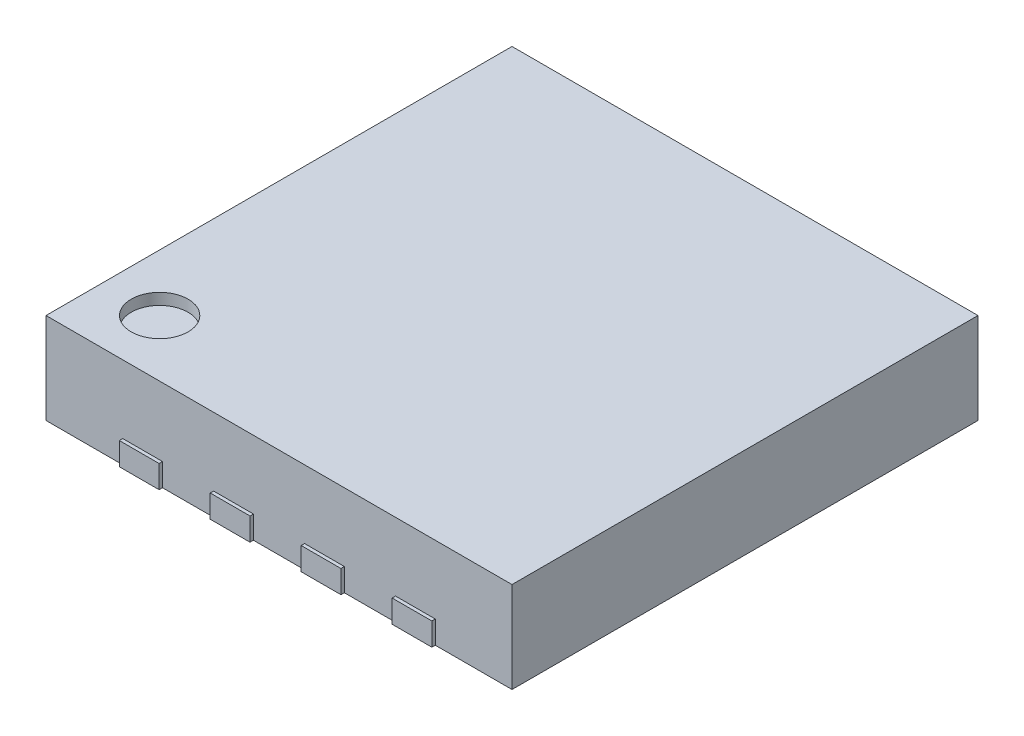
ISO-10303-21;
HEADER;
FILE_DESCRIPTION(('STEP AP214'),'2;1');
FILE_NAME('part.step','',(''),(''),'','','');
FILE_SCHEMA(('AUTOMOTIVE_DESIGN { 1 0 10303 214 1 1 1 1 }'));
ENDSEC;
DATA;
#1=APPLICATION_CONTEXT('core data for automotive mechanical design processes');
#2=APPLICATION_PROTOCOL_DEFINITION('international standard','automotive_design',2000,#1);
#3=PRODUCT_CONTEXT('',#1,'mechanical');
#4=PRODUCT('Part','Part','',(#3));
#5=PRODUCT_RELATED_PRODUCT_CATEGORY('part','',(#4));
#6=PRODUCT_DEFINITION_FORMATION('','',#4);
#7=PRODUCT_DEFINITION_CONTEXT('part definition',#1,'design');
#8=PRODUCT_DEFINITION('design','',#6,#7);
#9=PRODUCT_DEFINITION_SHAPE('','',#8);
#10=(LENGTH_UNIT() NAMED_UNIT(*) SI_UNIT(.MILLI.,.METRE.));
#11=(NAMED_UNIT(*) PLANE_ANGLE_UNIT() SI_UNIT($,.RADIAN.));
#12=(NAMED_UNIT(*) SI_UNIT($,.STERADIAN.) SOLID_ANGLE_UNIT());
#13=UNCERTAINTY_MEASURE_WITH_UNIT(LENGTH_MEASURE(1.E-05),#10,'distance_accuracy_value','');
#14=(GEOMETRIC_REPRESENTATION_CONTEXT(3) GLOBAL_UNCERTAINTY_ASSIGNED_CONTEXT((#13)) GLOBAL_UNIT_ASSIGNED_CONTEXT((#10,
#11,#12)) REPRESENTATION_CONTEXT('',''));
#15=CARTESIAN_POINT('',(0.,0.,0.));
#16=DIRECTION('',(0.,0.,1.));
#17=DIRECTION('',(1.,0.,0.));
#18=AXIS2_PLACEMENT_3D('',#15,#16,#17);
#19=CARTESIAN_POINT('',(-2.05,0.8,-2.05));
#20=DIRECTION('',(0.,0.,1.));
#21=DIRECTION('',(1.,0.,0.));
#22=AXIS2_PLACEMENT_3D('',#19,#20,#21);
#23=PLANE('',#22);
#24=DIRECTION('',(0.,1.,0.));
#25=VECTOR('',#24,1.);
#26=CARTESIAN_POINT('',(1.375,0.,-2.05));
#27=LINE('',#26,#25);
#28=CARTESIAN_POINT('',(1.375,0.,-2.05));
#29=VERTEX_POINT('',#28);
#30=CARTESIAN_POINT('',(1.375,0.2,-2.05));
#31=VERTEX_POINT('',#30);
#32=EDGE_CURVE('E53',#29,#31,#27,.T.);
#33=ORIENTED_EDGE('',*,*,#32,.T.);
#34=DIRECTION('',(-1.,0.,0.));
#35=VECTOR('',#34,1.);
#36=CARTESIAN_POINT('',(1.025,0.2,-2.05));
#37=LINE('',#36,#35);
#38=CARTESIAN_POINT('',(1.025,0.2,-2.05));
#39=VERTEX_POINT('',#38);
#40=EDGE_CURVE('E58',#31,#39,#37,.T.);
#41=ORIENTED_EDGE('',*,*,#40,.T.);
#42=DIRECTION('',(0.,-1.,0.));
#43=VECTOR('',#42,1.);
#44=CARTESIAN_POINT('',(1.025,0.,-2.05));
#45=LINE('',#44,#43);
#46=CARTESIAN_POINT('',(1.025,0.,-2.05));
#47=VERTEX_POINT('',#46);
#48=EDGE_CURVE('E284',#39,#47,#45,.T.);
#49=ORIENTED_EDGE('',*,*,#48,.T.);
#50=DIRECTION('',(-1.,0.,0.));
#51=VECTOR('',#50,1.);
#52=CARTESIAN_POINT('',(-2.05,0.,-2.05));
#53=LINE('',#52,#51);
#54=CARTESIAN_POINT('',(0.575,0.,-2.05));
#55=VERTEX_POINT('',#54);
#56=EDGE_CURVE('E39',#47,#55,#53,.T.);
#57=ORIENTED_EDGE('',*,*,#56,.T.);
#58=DIRECTION('',(0.,1.,0.));
#59=VECTOR('',#58,1.);
#60=CARTESIAN_POINT('',(0.575,0.,-2.05));
#61=LINE('',#60,#59);
#62=CARTESIAN_POINT('',(0.575,0.2,-2.05));
#63=VERTEX_POINT('',#62);
#64=EDGE_CURVE('E304',#55,#63,#61,.T.);
#65=ORIENTED_EDGE('',*,*,#64,.T.);
#66=DIRECTION('',(-1.,0.,0.));
#67=VECTOR('',#66,1.);
#68=CARTESIAN_POINT('',(0.225,0.2,-2.05));
#69=LINE('',#68,#67);
#70=CARTESIAN_POINT('',(0.225,0.2,-2.05));
#71=VERTEX_POINT('',#70);
#72=EDGE_CURVE('E306',#63,#71,#69,.T.);
#73=ORIENTED_EDGE('',*,*,#72,.T.);
#74=DIRECTION('',(0.,-1.,0.));
#75=VECTOR('',#74,1.);
#76=CARTESIAN_POINT('',(0.225,0.,-2.05));
#77=LINE('',#76,#75);
#78=CARTESIAN_POINT('',(0.225,0.,-2.05));
#79=VERTEX_POINT('',#78);
#80=EDGE_CURVE('E309',#71,#79,#77,.T.);
#81=ORIENTED_EDGE('',*,*,#80,.T.);
#82=CARTESIAN_POINT('',(-0.225,0.,-2.05));
#83=VERTEX_POINT('',#82);
#84=EDGE_CURVE('E282',#79,#83,#53,.T.);
#85=ORIENTED_EDGE('',*,*,#84,.T.);
#86=DIRECTION('',(0.,1.,0.));
#87=VECTOR('',#86,1.);
#88=CARTESIAN_POINT('',(-0.225,0.,-2.05));
#89=LINE('',#88,#87);
#90=CARTESIAN_POINT('',(-0.225,0.2,-2.05));
#91=VERTEX_POINT('',#90);
#92=EDGE_CURVE('E329',#83,#91,#89,.T.);
#93=ORIENTED_EDGE('',*,*,#92,.T.);
#94=DIRECTION('',(-1.,0.,0.));
#95=VECTOR('',#94,1.);
#96=CARTESIAN_POINT('',(-0.575,0.2,-2.05));
#97=LINE('',#96,#95);
#98=CARTESIAN_POINT('',(-0.575,0.2,-2.05));
#99=VERTEX_POINT('',#98);
#100=EDGE_CURVE('E331',#91,#99,#97,.T.);
#101=ORIENTED_EDGE('',*,*,#100,.T.);
#102=DIRECTION('',(0.,-1.,0.));
#103=VECTOR('',#102,1.);
#104=CARTESIAN_POINT('',(-0.575,0.,-2.05));
#105=LINE('',#104,#103);
#106=CARTESIAN_POINT('',(-0.575,0.,-2.05));
#107=VERTEX_POINT('',#106);
#108=EDGE_CURVE('E334',#99,#107,#105,.T.);
#109=ORIENTED_EDGE('',*,*,#108,.T.);
#110=CARTESIAN_POINT('',(-1.025,0.,-2.05));
#111=VERTEX_POINT('',#110);
#112=EDGE_CURVE('E377',#107,#111,#53,.T.);
#113=ORIENTED_EDGE('',*,*,#112,.T.);
#114=DIRECTION('',(0.,1.,0.));
#115=VECTOR('',#114,1.);
#116=CARTESIAN_POINT('',(-1.025,0.,-2.05));
#117=LINE('',#116,#115);
#118=CARTESIAN_POINT('',(-1.025,0.2,-2.05));
#119=VERTEX_POINT('',#118);
#120=EDGE_CURVE('E366',#111,#119,#117,.T.);
#121=ORIENTED_EDGE('',*,*,#120,.T.);
#122=DIRECTION('',(-1.,0.,0.));
#123=VECTOR('',#122,1.);
#124=CARTESIAN_POINT('',(-1.375,0.2,-2.05));
#125=LINE('',#124,#123);
#126=CARTESIAN_POINT('',(-1.375,0.2,-2.05));
#127=VERTEX_POINT('',#126);
#128=EDGE_CURVE('E359',#119,#127,#125,.T.);
#129=ORIENTED_EDGE('',*,*,#128,.T.);
#130=DIRECTION('',(0.,-1.,0.));
#131=VECTOR('',#130,1.);
#132=CARTESIAN_POINT('',(-1.375,0.,-2.05));
#133=LINE('',#132,#131);
#134=CARTESIAN_POINT('',(-1.375,0.,-2.05));
#135=VERTEX_POINT('',#134);
#136=EDGE_CURVE('E362',#127,#135,#133,.T.);
#137=ORIENTED_EDGE('',*,*,#136,.T.);
#138=CARTESIAN_POINT('',(-2.05,0.,-2.05));
#139=VERTEX_POINT('',#138);
#140=EDGE_CURVE('E378',#135,#139,#53,.T.);
#141=ORIENTED_EDGE('',*,*,#140,.T.);
#142=DIRECTION('',(0.,-1.,0.));
#143=VECTOR('',#142,1.);
#144=CARTESIAN_POINT('',(-2.05,0.8,-2.05));
#145=LINE('',#144,#143);
#146=CARTESIAN_POINT('',(-2.05,0.8,-2.05));
#147=VERTEX_POINT('',#146);
#148=EDGE_CURVE('E384',#147,#139,#145,.T.);
#149=ORIENTED_EDGE('',*,*,#148,.F.);
#150=DIRECTION('',(-1.,0.,0.));
#151=VECTOR('',#150,1.);
#152=CARTESIAN_POINT('',(-2.05,0.8,-2.05));
#153=LINE('',#152,#151);
#154=CARTESIAN_POINT('',(2.05,0.8,-2.05));
#155=VERTEX_POINT('',#154);
#156=EDGE_CURVE('E450',#155,#147,#153,.T.);
#157=ORIENTED_EDGE('',*,*,#156,.F.);
#158=DIRECTION('',(0.,-1.,0.));
#159=VECTOR('',#158,1.);
#160=CARTESIAN_POINT('',(2.05,0.8,-2.05));
#161=LINE('',#160,#159);
#162=CARTESIAN_POINT('',(2.05,0.,-2.05));
#163=VERTEX_POINT('',#162);
#164=EDGE_CURVE('E455',#155,#163,#161,.T.);
#165=ORIENTED_EDGE('',*,*,#164,.T.);
#166=EDGE_CURVE('E281',#163,#29,#53,.T.);
#167=ORIENTED_EDGE('',*,*,#166,.T.);
#168=EDGE_LOOP('',(#33,#41,#49,#57,#65,#73,#81,#85,#93,#101,#109,#113,#121,#129,#137,#141,#149,
#157,#165,#167));
#169=FACE_BOUND('',#168,.T.);
#170=ADVANCED_FACE('F35',(#169),#23,.F.);
#171=CARTESIAN_POINT('',(-2.05,0.8,2.05));
#172=DIRECTION('',(0.,0.,-1.));
#173=DIRECTION('',(-1.,0.,0.));
#174=AXIS2_PLACEMENT_3D('',#171,#172,#173);
#175=PLANE('',#174);
#176=DIRECTION('',(0.,1.,0.));
#177=VECTOR('',#176,1.);
#178=CARTESIAN_POINT('',(1.375,0.,2.05));
#179=LINE('',#178,#177);
#180=CARTESIAN_POINT('',(1.375,0.,2.05));
#181=VERTEX_POINT('',#180);
#182=CARTESIAN_POINT('',(1.375,0.2,2.05));
#183=VERTEX_POINT('',#182);
#184=EDGE_CURVE('E373',#181,#183,#179,.T.);
#185=ORIENTED_EDGE('',*,*,#184,.F.);
#186=DIRECTION('',(1.,0.,0.));
#187=VECTOR('',#186,1.);
#188=CARTESIAN_POINT('',(-2.05,0.,2.05));
#189=LINE('',#188,#187);
#190=CARTESIAN_POINT('',(2.05,0.,2.05));
#191=VERTEX_POINT('',#190);
#192=EDGE_CURVE('E395',#181,#191,#189,.T.);
#193=ORIENTED_EDGE('',*,*,#192,.T.);
#194=DIRECTION('',(0.,-1.,0.));
#195=VECTOR('',#194,1.);
#196=CARTESIAN_POINT('',(2.05,0.8,2.05));
#197=LINE('',#196,#195);
#198=CARTESIAN_POINT('',(2.05,0.8,2.05));
#199=VERTEX_POINT('',#198);
#200=EDGE_CURVE('E45',#199,#191,#197,.T.);
#201=ORIENTED_EDGE('',*,*,#200,.F.);
#202=DIRECTION('',(1.,0.,0.));
#203=VECTOR('',#202,1.);
#204=CARTESIAN_POINT('',(-2.05,0.8,2.05));
#205=LINE('',#204,#203);
#206=CARTESIAN_POINT('',(-2.05,0.8,2.05));
#207=VERTEX_POINT('',#206);
#208=EDGE_CURVE('E447',#207,#199,#205,.T.);
#209=ORIENTED_EDGE('',*,*,#208,.F.);
#210=DIRECTION('',(0.,-1.,0.));
#211=VECTOR('',#210,1.);
#212=CARTESIAN_POINT('',(-2.05,0.8,2.05));
#213=LINE('',#212,#211);
#214=CARTESIAN_POINT('',(-2.05,0.,2.05));
#215=VERTEX_POINT('',#214);
#216=EDGE_CURVE('E11',#207,#215,#213,.T.);
#217=ORIENTED_EDGE('',*,*,#216,.T.);
#218=CARTESIAN_POINT('',(-1.375,0.,2.05));
#219=VERTEX_POINT('',#218);
#220=EDGE_CURVE('E411',#215,#219,#189,.T.);
#221=ORIENTED_EDGE('',*,*,#220,.T.);
#222=DIRECTION('',(0.,-1.,0.));
#223=VECTOR('',#222,1.);
#224=CARTESIAN_POINT('',(-1.375,0.,2.05));
#225=LINE('',#224,#223);
#226=CARTESIAN_POINT('',(-1.375,0.2,2.05));
#227=VERTEX_POINT('',#226);
#228=EDGE_CURVE('E414',#227,#219,#225,.T.);
#229=ORIENTED_EDGE('',*,*,#228,.F.);
#230=DIRECTION('',(-1.,0.,0.));
#231=VECTOR('',#230,1.);
#232=CARTESIAN_POINT('',(-1.375,0.2,2.05));
#233=LINE('',#232,#231);
#234=CARTESIAN_POINT('',(-1.025,0.2,2.05));
#235=VERTEX_POINT('',#234);
#236=EDGE_CURVE('E427',#235,#227,#233,.T.);
#237=ORIENTED_EDGE('',*,*,#236,.F.);
#238=DIRECTION('',(0.,1.,0.));
#239=VECTOR('',#238,1.);
#240=CARTESIAN_POINT('',(-1.025,0.,2.05));
#241=LINE('',#240,#239);
#242=CARTESIAN_POINT('',(-1.025,0.,2.05));
#243=VERTEX_POINT('',#242);
#244=EDGE_CURVE('E418',#243,#235,#241,.T.);
#245=ORIENTED_EDGE('',*,*,#244,.F.);
#246=CARTESIAN_POINT('',(-0.575,0.,2.05));
#247=VERTEX_POINT('',#246);
#248=EDGE_CURVE('E406',#243,#247,#189,.T.);
#249=ORIENTED_EDGE('',*,*,#248,.T.);
#250=DIRECTION('',(0.,-1.,0.));
#251=VECTOR('',#250,1.);
#252=CARTESIAN_POINT('',(-0.575,0.,2.05));
#253=LINE('',#252,#251);
#254=CARTESIAN_POINT('',(-0.575,0.2,2.05));
#255=VERTEX_POINT('',#254);
#256=EDGE_CURVE('E477',#255,#247,#253,.T.);
#257=ORIENTED_EDGE('',*,*,#256,.F.);
#258=DIRECTION('',(-1.,0.,0.));
#259=VECTOR('',#258,1.);
#260=CARTESIAN_POINT('',(-0.575,0.2,2.05));
#261=LINE('',#260,#259);
#262=CARTESIAN_POINT('',(-0.225,0.2,2.05));
#263=VERTEX_POINT('',#262);
#264=EDGE_CURVE('E493',#263,#255,#261,.T.);
#265=ORIENTED_EDGE('',*,*,#264,.F.);
#266=DIRECTION('',(0.,1.,0.));
#267=VECTOR('',#266,1.);
#268=CARTESIAN_POINT('',(-0.225,0.,2.05));
#269=LINE('',#268,#267);
#270=CARTESIAN_POINT('',(-0.225,0.,2.05));
#271=VERTEX_POINT('',#270);
#272=EDGE_CURVE('E639',#271,#263,#269,.T.);
#273=ORIENTED_EDGE('',*,*,#272,.F.);
#274=CARTESIAN_POINT('',(0.225,0.,2.05));
#275=VERTEX_POINT('',#274);
#276=EDGE_CURVE('E412',#271,#275,#189,.T.);
#277=ORIENTED_EDGE('',*,*,#276,.T.);
#278=DIRECTION('',(0.,-1.,0.));
#279=VECTOR('',#278,1.);
#280=CARTESIAN_POINT('',(0.225,0.,2.05));
#281=LINE('',#280,#279);
#282=CARTESIAN_POINT('',(0.225,0.2,2.05));
#283=VERTEX_POINT('',#282);
#284=EDGE_CURVE('E614',#283,#275,#281,.T.);
#285=ORIENTED_EDGE('',*,*,#284,.F.);
#286=DIRECTION('',(-1.,0.,0.));
#287=VECTOR('',#286,1.);
#288=CARTESIAN_POINT('',(0.225,0.2,2.05));
#289=LINE('',#288,#287);
#290=CARTESIAN_POINT('',(0.575,0.2,2.05));
#291=VERTEX_POINT('',#290);
#292=EDGE_CURVE('E623',#291,#283,#289,.T.);
#293=ORIENTED_EDGE('',*,*,#292,.F.);
#294=DIRECTION('',(0.,1.,0.));
#295=VECTOR('',#294,1.);
#296=CARTESIAN_POINT('',(0.575,0.,2.05));
#297=LINE('',#296,#295);
#298=CARTESIAN_POINT('',(0.575,0.,2.05));
#299=VERTEX_POINT('',#298);
#300=EDGE_CURVE('E609',#299,#291,#297,.T.);
#301=ORIENTED_EDGE('',*,*,#300,.F.);
#302=CARTESIAN_POINT('',(1.025,0.,2.05));
#303=VERTEX_POINT('',#302);
#304=EDGE_CURVE('E397',#299,#303,#189,.T.);
#305=ORIENTED_EDGE('',*,*,#304,.T.);
#306=DIRECTION('',(0.,-1.,0.));
#307=VECTOR('',#306,1.);
#308=CARTESIAN_POINT('',(1.025,0.,2.05));
#309=LINE('',#308,#307);
#310=CARTESIAN_POINT('',(1.025,0.2,2.05));
#311=VERTEX_POINT('',#310);
#312=EDGE_CURVE('E584',#311,#303,#309,.T.);
#313=ORIENTED_EDGE('',*,*,#312,.F.);
#314=DIRECTION('',(-1.,0.,0.));
#315=VECTOR('',#314,1.);
#316=CARTESIAN_POINT('',(1.025,0.2,2.05));
#317=LINE('',#316,#315);
#318=EDGE_CURVE('E593',#183,#311,#317,.T.);
#319=ORIENTED_EDGE('',*,*,#318,.F.);
#320=EDGE_LOOP('',(#185,#193,#201,#209,#217,#221,#229,#237,#245,#249,#257,#265,#273,#277,#285,
#293,#301,#305,#313,#319));
#321=FACE_BOUND('',#320,.T.);
#322=ADVANCED_FACE('F476',(#321),#175,.F.);
#323=CARTESIAN_POINT('',(-2.05,0.8,2.05));
#324=DIRECTION('',(1.,0.,0.));
#325=DIRECTION('',(0.,0.,-1.));
#326=AXIS2_PLACEMENT_3D('',#323,#324,#325);
#327=PLANE('',#326);
#328=DIRECTION('',(0.,0.,1.));
#329=VECTOR('',#328,1.);
#330=CARTESIAN_POINT('',(-2.05,0.,2.05));
#331=LINE('',#330,#329);
#332=EDGE_CURVE('E398',#139,#215,#331,.T.);
#333=ORIENTED_EDGE('',*,*,#332,.T.);
#334=ORIENTED_EDGE('',*,*,#216,.F.);
#335=DIRECTION('',(0.,0.,1.));
#336=VECTOR('',#335,1.);
#337=CARTESIAN_POINT('',(-2.05,0.8,2.05));
#338=LINE('',#337,#336);
#339=EDGE_CURVE('E394',#147,#207,#338,.T.);
#340=ORIENTED_EDGE('',*,*,#339,.F.);
#341=ORIENTED_EDGE('',*,*,#148,.T.);
#342=EDGE_LOOP('',(#333,#334,#340,#341));
#343=FACE_BOUND('',#342,.T.);
#344=ADVANCED_FACE('F37',(#343),#327,.F.);
#345=CARTESIAN_POINT('',(2.05,0.8,2.05));
#346=DIRECTION('',(-1.,0.,0.));
#347=DIRECTION('',(0.,0.,1.));
#348=AXIS2_PLACEMENT_3D('',#345,#346,#347);
#349=PLANE('',#348);
#350=DIRECTION('',(0.,0.,-1.));
#351=VECTOR('',#350,1.);
#352=CARTESIAN_POINT('',(2.05,0.,2.05));
#353=LINE('',#352,#351);
#354=EDGE_CURVE('E382',#191,#163,#353,.T.);
#355=ORIENTED_EDGE('',*,*,#354,.T.);
#356=ORIENTED_EDGE('',*,*,#164,.F.);
#357=DIRECTION('',(0.,0.,-1.));
#358=VECTOR('',#357,1.);
#359=CARTESIAN_POINT('',(2.05,0.8,2.05));
#360=LINE('',#359,#358);
#361=EDGE_CURVE('E449',#199,#155,#360,.T.);
#362=ORIENTED_EDGE('',*,*,#361,.F.);
#363=ORIENTED_EDGE('',*,*,#200,.T.);
#364=EDGE_LOOP('',(#355,#356,#362,#363));
#365=FACE_BOUND('',#364,.T.);
#366=ADVANCED_FACE('F468',(#365),#349,.F.);
#367=CARTESIAN_POINT('',(0.,0.8,0.));
#368=DIRECTION('',(0.,-1.,0.));
#369=DIRECTION('',(0.,0.,-1.));
#370=AXIS2_PLACEMENT_3D('',#367,#368,#369);
#371=PLANE('',#370);
#372=CARTESIAN_POINT('',(-1.55,0.8,1.55));
#373=DIRECTION('',(0.,1.,0.));
#374=DIRECTION('',(0.,0.,1.));
#375=AXIS2_PLACEMENT_3D('',#372,#373,#374);
#376=CIRCLE('',#375,0.25);
#377=CARTESIAN_POINT('',(-1.55,0.8,1.8));
#378=VERTEX_POINT('',#377);
#379=EDGE_CURVE('E441',#378,#378,#376,.T.);
#380=ORIENTED_EDGE('',*,*,#379,.F.);
#381=EDGE_LOOP('',(#380));
#382=FACE_BOUND('',#381,.T.);
#383=ORIENTED_EDGE('',*,*,#339,.T.);
#384=ORIENTED_EDGE('',*,*,#208,.T.);
#385=ORIENTED_EDGE('',*,*,#361,.T.);
#386=ORIENTED_EDGE('',*,*,#156,.T.);
#387=EDGE_LOOP('',(#383,#384,#385,#386));
#388=FACE_BOUND('',#387,.T.);
#389=ADVANCED_FACE('F550',(#382,#388),#371,.F.);
#390=CARTESIAN_POINT('',(0.,0.,0.));
#391=DIRECTION('',(0.,-1.,0.));
#392=DIRECTION('',(0.,0.,-1.));
#393=AXIS2_PLACEMENT_3D('',#390,#391,#392);
#394=PLANE('',#393);
#395=ORIENTED_EDGE('',*,*,#332,.F.);
#396=ORIENTED_EDGE('',*,*,#140,.F.);
#397=DIRECTION('',(0.,0.,-1.));
#398=VECTOR('',#397,1.);
#399=CARTESIAN_POINT('',(-1.375,0.,-2.05));
#400=LINE('',#399,#398);
#401=CARTESIAN_POINT('',(-1.375,0.,-2.08));
#402=VERTEX_POINT('',#401);
#403=EDGE_CURVE('E370',#135,#402,#400,.T.);
#404=ORIENTED_EDGE('',*,*,#403,.T.);
#405=DIRECTION('',(1.,0.,0.));
#406=VECTOR('',#405,1.);
#407=CARTESIAN_POINT('',(-1.375,0.,-2.08));
#408=LINE('',#407,#406);
#409=CARTESIAN_POINT('',(-1.025,0.,-2.08));
#410=VERTEX_POINT('',#409);
#411=EDGE_CURVE('E984',#402,#410,#408,.T.);
#412=ORIENTED_EDGE('',*,*,#411,.T.);
#413=DIRECTION('',(0.,0.,-1.));
#414=VECTOR('',#413,1.);
#415=CARTESIAN_POINT('',(-1.025,0.,-2.05));
#416=LINE('',#415,#414);
#417=EDGE_CURVE('E374',#111,#410,#416,.T.);
#418=ORIENTED_EDGE('',*,*,#417,.F.);
#419=ORIENTED_EDGE('',*,*,#112,.F.);
#420=DIRECTION('',(0.,0.,-1.));
#421=VECTOR('',#420,1.);
#422=CARTESIAN_POINT('',(-0.575,0.,-2.05));
#423=LINE('',#422,#421);
#424=CARTESIAN_POINT('',(-0.575,0.,-2.08));
#425=VERTEX_POINT('',#424);
#426=EDGE_CURVE('E337',#107,#425,#423,.T.);
#427=ORIENTED_EDGE('',*,*,#426,.T.);
#428=DIRECTION('',(1.,0.,0.));
#429=VECTOR('',#428,1.);
#430=CARTESIAN_POINT('',(-0.575,0.,-2.08));
#431=LINE('',#430,#429);
#432=CARTESIAN_POINT('',(-0.225,0.,-2.08));
#433=VERTEX_POINT('',#432);
#434=EDGE_CURVE('E328',#425,#433,#431,.T.);
#435=ORIENTED_EDGE('',*,*,#434,.T.);
#436=DIRECTION('',(0.,0.,-1.));
#437=VECTOR('',#436,1.);
#438=CARTESIAN_POINT('',(-0.225,0.,-2.05));
#439=LINE('',#438,#437);
#440=EDGE_CURVE('E353',#83,#433,#439,.T.);
#441=ORIENTED_EDGE('',*,*,#440,.F.);
#442=ORIENTED_EDGE('',*,*,#84,.F.);
#443=DIRECTION('',(0.,0.,-1.));
#444=VECTOR('',#443,1.);
#445=CARTESIAN_POINT('',(0.225,0.,-2.05));
#446=LINE('',#445,#444);
#447=CARTESIAN_POINT('',(0.225,0.,-2.08));
#448=VERTEX_POINT('',#447);
#449=EDGE_CURVE('E312',#79,#448,#446,.T.);
#450=ORIENTED_EDGE('',*,*,#449,.T.);
#451=DIRECTION('',(1.,0.,0.));
#452=VECTOR('',#451,1.);
#453=CARTESIAN_POINT('',(0.225,0.,-2.08));
#454=LINE('',#453,#452);
#455=CARTESIAN_POINT('',(0.575,0.,-2.08));
#456=VERTEX_POINT('',#455);
#457=EDGE_CURVE('E303',#448,#456,#454,.T.);
#458=ORIENTED_EDGE('',*,*,#457,.T.);
#459=DIRECTION('',(0.,0.,-1.));
#460=VECTOR('',#459,1.);
#461=CARTESIAN_POINT('',(0.575,0.,-2.05));
#462=LINE('',#461,#460);
#463=EDGE_CURVE('E279',#55,#456,#462,.T.);
#464=ORIENTED_EDGE('',*,*,#463,.F.);
#465=ORIENTED_EDGE('',*,*,#56,.F.);
#466=DIRECTION('',(0.,0.,-1.));
#467=VECTOR('',#466,1.);
#468=CARTESIAN_POINT('',(1.025,0.,-2.05));
#469=LINE('',#468,#467);
#470=CARTESIAN_POINT('',(1.025,0.,-2.08));
#471=VERTEX_POINT('',#470);
#472=EDGE_CURVE('E275',#47,#471,#469,.T.);
#473=ORIENTED_EDGE('',*,*,#472,.T.);
#474=DIRECTION('',(1.,0.,0.));
#475=VECTOR('',#474,1.);
#476=CARTESIAN_POINT('',(1.025,0.,-2.08));
#477=LINE('',#476,#475);
#478=CARTESIAN_POINT('',(1.375,0.,-2.08));
#479=VERTEX_POINT('',#478);
#480=EDGE_CURVE('E952',#471,#479,#477,.T.);
#481=ORIENTED_EDGE('',*,*,#480,.T.);
#482=DIRECTION('',(0.,0.,-1.));
#483=VECTOR('',#482,1.);
#484=CARTESIAN_POINT('',(1.375,0.,-2.05));
#485=LINE('',#484,#483);
#486=EDGE_CURVE('E300',#29,#479,#485,.T.);
#487=ORIENTED_EDGE('',*,*,#486,.F.);
#488=ORIENTED_EDGE('',*,*,#166,.F.);
#489=ORIENTED_EDGE('',*,*,#354,.F.);
#490=ORIENTED_EDGE('',*,*,#192,.F.);
#491=DIRECTION('',(0.,0.,-1.));
#492=VECTOR('',#491,1.);
#493=CARTESIAN_POINT('',(1.375,0.,2.08));
#494=LINE('',#493,#492);
#495=CARTESIAN_POINT('',(1.375,0.,2.08));
#496=VERTEX_POINT('',#495);
#497=EDGE_CURVE('E606',#496,#181,#494,.T.);
#498=ORIENTED_EDGE('',*,*,#497,.F.);
#499=DIRECTION('',(1.,0.,0.));
#500=VECTOR('',#499,1.);
#501=CARTESIAN_POINT('',(1.025,0.,2.08));
#502=LINE('',#501,#500);
#503=CARTESIAN_POINT('',(1.025,0.,2.08));
#504=VERTEX_POINT('',#503);
#505=EDGE_CURVE('E580',#504,#496,#502,.T.);
#506=ORIENTED_EDGE('',*,*,#505,.F.);
#507=DIRECTION('',(0.,0.,-1.));
#508=VECTOR('',#507,1.);
#509=CARTESIAN_POINT('',(1.025,0.,2.08));
#510=LINE('',#509,#508);
#511=EDGE_CURVE('E590',#504,#303,#510,.T.);
#512=ORIENTED_EDGE('',*,*,#511,.T.);
#513=ORIENTED_EDGE('',*,*,#304,.F.);
#514=DIRECTION('',(0.,0.,-1.));
#515=VECTOR('',#514,1.);
#516=CARTESIAN_POINT('',(0.575,0.,2.08));
#517=LINE('',#516,#515);
#518=CARTESIAN_POINT('',(0.575,0.,2.08));
#519=VERTEX_POINT('',#518);
#520=EDGE_CURVE('E636',#519,#299,#517,.T.);
#521=ORIENTED_EDGE('',*,*,#520,.F.);
#522=DIRECTION('',(1.,0.,0.));
#523=VECTOR('',#522,1.);
#524=CARTESIAN_POINT('',(0.225,0.,2.08));
#525=LINE('',#524,#523);
#526=CARTESIAN_POINT('',(0.225,0.,2.08));
#527=VERTEX_POINT('',#526);
#528=EDGE_CURVE('E610',#527,#519,#525,.T.);
#529=ORIENTED_EDGE('',*,*,#528,.F.);
#530=DIRECTION('',(0.,0.,-1.));
#531=VECTOR('',#530,1.);
#532=CARTESIAN_POINT('',(0.225,0.,2.08));
#533=LINE('',#532,#531);
#534=EDGE_CURVE('E620',#527,#275,#533,.T.);
#535=ORIENTED_EDGE('',*,*,#534,.T.);
#536=ORIENTED_EDGE('',*,*,#276,.F.);
#537=DIRECTION('',(0.,0.,-1.));
#538=VECTOR('',#537,1.);
#539=CARTESIAN_POINT('',(-0.225,0.,2.08));
#540=LINE('',#539,#538);
#541=CARTESIAN_POINT('',(-0.225,0.,2.08));
#542=VERTEX_POINT('',#541);
#543=EDGE_CURVE('E419',#542,#271,#540,.T.);
#544=ORIENTED_EDGE('',*,*,#543,.F.);
#545=DIRECTION('',(1.,0.,0.));
#546=VECTOR('',#545,1.);
#547=CARTESIAN_POINT('',(-0.575,0.,2.08));
#548=LINE('',#547,#546);
#549=CARTESIAN_POINT('',(-0.575,0.,2.08));
#550=VERTEX_POINT('',#549);
#551=EDGE_CURVE('E492',#550,#542,#548,.T.);
#552=ORIENTED_EDGE('',*,*,#551,.F.);
#553=DIRECTION('',(0.,0.,-1.));
#554=VECTOR('',#553,1.);
#555=CARTESIAN_POINT('',(-0.575,0.,2.08));
#556=LINE('',#555,#554);
#557=EDGE_CURVE('E488',#550,#247,#556,.T.);
#558=ORIENTED_EDGE('',*,*,#557,.T.);
#559=ORIENTED_EDGE('',*,*,#248,.F.);
#560=DIRECTION('',(0.,0.,-1.));
#561=VECTOR('',#560,1.);
#562=CARTESIAN_POINT('',(-1.025,0.,2.08));
#563=LINE('',#562,#561);
#564=CARTESIAN_POINT('',(-1.025,0.,2.08));
#565=VERTEX_POINT('',#564);
#566=EDGE_CURVE('E437',#565,#243,#563,.T.);
#567=ORIENTED_EDGE('',*,*,#566,.F.);
#568=DIRECTION('',(1.,0.,0.));
#569=VECTOR('',#568,1.);
#570=CARTESIAN_POINT('',(-1.375,0.,2.08));
#571=LINE('',#570,#569);
#572=CARTESIAN_POINT('',(-1.375,0.,2.08));
#573=VERTEX_POINT('',#572);
#574=EDGE_CURVE('E511',#573,#565,#571,.T.);
#575=ORIENTED_EDGE('',*,*,#574,.F.);
#576=DIRECTION('',(0.,0.,-1.));
#577=VECTOR('',#576,1.);
#578=CARTESIAN_POINT('',(-1.375,0.,2.08));
#579=LINE('',#578,#577);
#580=EDGE_CURVE('E444',#573,#219,#579,.T.);
#581=ORIENTED_EDGE('',*,*,#580,.T.);
#582=ORIENTED_EDGE('',*,*,#220,.F.);
#583=EDGE_LOOP('',(#395,#396,#404,#412,#418,#419,#427,#435,#441,#442,#450,#458,#464,#465,#473,
#481,#487,#488,#489,#490,#498,#506,#512,#513,#521,#529,#535,#536,#544,#552,#558,#559,#567,#575,
#581,#582));
#584=FACE_BOUND('',#583,.T.);
#585=ADVANCED_FACE('F272',(#584),#394,.T.);
#586=CARTESIAN_POINT('',(-1.55,0.7,1.55));
#587=DIRECTION('',(0.,1.,0.));
#588=DIRECTION('',(0.,0.,1.));
#589=AXIS2_PLACEMENT_3D('',#586,#587,#588);
#590=CYLINDRICAL_SURFACE('',#589,0.25);
#591=CARTESIAN_POINT('',(-1.55,0.7,1.55));
#592=DIRECTION('',(0.,1.,0.));
#593=DIRECTION('',(0.,0.,1.));
#594=AXIS2_PLACEMENT_3D('',#591,#592,#593);
#595=CIRCLE('',#594,0.25);
#596=CARTESIAN_POINT('',(-1.55,0.7,1.8));
#597=VERTEX_POINT('',#596);
#598=EDGE_CURVE('E438',#597,#597,#595,.T.);
#599=ORIENTED_EDGE('',*,*,#598,.F.);
#600=EDGE_LOOP('',(#599));
#601=FACE_BOUND('',#600,.T.);
#602=ORIENTED_EDGE('',*,*,#379,.T.);
#603=EDGE_LOOP('',(#602));
#604=FACE_BOUND('',#603,.T.);
#605=ADVANCED_FACE('F782',(#601,#604),#590,.F.);
#606=CARTESIAN_POINT('',(-1.55,0.7,1.55));
#607=DIRECTION('',(0.,1.,0.));
#608=DIRECTION('',(0.,0.,1.));
#609=AXIS2_PLACEMENT_3D('',#606,#607,#608);
#610=PLANE('',#609);
#611=ORIENTED_EDGE('',*,*,#598,.T.);
#612=EDGE_LOOP('',(#611));
#613=FACE_BOUND('',#612,.T.);
#614=ADVANCED_FACE('F539',(#613),#610,.T.);
#615=CARTESIAN_POINT('',(-1.375,0.,2.08));
#616=DIRECTION('',(1.,0.,0.));
#617=DIRECTION('',(0.,0.,-1.));
#618=AXIS2_PLACEMENT_3D('',#615,#616,#617);
#619=PLANE('',#618);
#620=ORIENTED_EDGE('',*,*,#228,.T.);
#621=ORIENTED_EDGE('',*,*,#580,.F.);
#622=DIRECTION('',(0.,-1.,0.));
#623=VECTOR('',#622,1.);
#624=CARTESIAN_POINT('',(-1.375,0.,2.08));
#625=LINE('',#624,#623);
#626=CARTESIAN_POINT('',(-1.375,0.2,2.08));
#627=VERTEX_POINT('',#626);
#628=EDGE_CURVE('E430',#627,#573,#625,.T.);
#629=ORIENTED_EDGE('',*,*,#628,.F.);
#630=DIRECTION('',(0.,0.,-1.));
#631=VECTOR('',#630,1.);
#632=CARTESIAN_POINT('',(-1.375,0.2,2.08));
#633=LINE('',#632,#631);
#634=EDGE_CURVE('E431',#627,#227,#633,.T.);
#635=ORIENTED_EDGE('',*,*,#634,.T.);
#636=EDGE_LOOP('',(#620,#621,#629,#635));
#637=FACE_BOUND('',#636,.T.);
#638=ADVANCED_FACE('F524',(#637),#619,.F.);
#639=CARTESIAN_POINT('',(-1.025,0.,2.08));
#640=DIRECTION('',(-1.,0.,0.));
#641=DIRECTION('',(0.,0.,1.));
#642=AXIS2_PLACEMENT_3D('',#639,#640,#641);
#643=PLANE('',#642);
#644=ORIENTED_EDGE('',*,*,#244,.T.);
#645=DIRECTION('',(0.,0.,-1.));
#646=VECTOR('',#645,1.);
#647=CARTESIAN_POINT('',(-1.025,0.2,2.08));
#648=LINE('',#647,#646);
#649=CARTESIAN_POINT('',(-1.025,0.2,2.08));
#650=VERTEX_POINT('',#649);
#651=EDGE_CURVE('E434',#650,#235,#648,.T.);
#652=ORIENTED_EDGE('',*,*,#651,.F.);
#653=DIRECTION('',(0.,1.,0.));
#654=VECTOR('',#653,1.);
#655=CARTESIAN_POINT('',(-1.025,0.,2.08));
#656=LINE('',#655,#654);
#657=EDGE_CURVE('E512',#565,#650,#656,.T.);
#658=ORIENTED_EDGE('',*,*,#657,.F.);
#659=ORIENTED_EDGE('',*,*,#566,.T.);
#660=EDGE_LOOP('',(#644,#652,#658,#659));
#661=FACE_BOUND('',#660,.T.);
#662=ADVANCED_FACE('F531',(#661),#643,.F.);
#663=CARTESIAN_POINT('',(-1.375,0.2,2.08));
#664=DIRECTION('',(0.,-1.,0.));
#665=DIRECTION('',(0.,0.,-1.));
#666=AXIS2_PLACEMENT_3D('',#663,#664,#665);
#667=PLANE('',#666);
#668=ORIENTED_EDGE('',*,*,#236,.T.);
#669=ORIENTED_EDGE('',*,*,#634,.F.);
#670=DIRECTION('',(-1.,0.,0.));
#671=VECTOR('',#670,1.);
#672=CARTESIAN_POINT('',(-1.375,0.2,2.08));
#673=LINE('',#672,#671);
#674=EDGE_CURVE('E425',#650,#627,#673,.T.);
#675=ORIENTED_EDGE('',*,*,#674,.F.);
#676=ORIENTED_EDGE('',*,*,#651,.T.);
#677=EDGE_LOOP('',(#668,#669,#675,#676));
#678=FACE_BOUND('',#677,.T.);
#679=ADVANCED_FACE('F522',(#678),#667,.F.);
#680=CARTESIAN_POINT('',(0.,0.,2.08));
#681=DIRECTION('',(0.,0.,-1.));
#682=DIRECTION('',(-1.,0.,0.));
#683=AXIS2_PLACEMENT_3D('',#680,#681,#682);
#684=PLANE('',#683);
#685=ORIENTED_EDGE('',*,*,#628,.T.);
#686=ORIENTED_EDGE('',*,*,#574,.T.);
#687=ORIENTED_EDGE('',*,*,#657,.T.);
#688=ORIENTED_EDGE('',*,*,#674,.T.);
#689=EDGE_LOOP('',(#685,#686,#687,#688));
#690=FACE_BOUND('',#689,.T.);
#691=ADVANCED_FACE('F518',(#690),#684,.F.);
#692=CARTESIAN_POINT('',(-0.225,0.,2.08));
#693=DIRECTION('',(-1.,0.,0.));
#694=DIRECTION('',(0.,0.,1.));
#695=AXIS2_PLACEMENT_3D('',#692,#693,#694);
#696=PLANE('',#695);
#697=ORIENTED_EDGE('',*,*,#272,.T.);
#698=DIRECTION('',(0.,0.,-1.));
#699=VECTOR('',#698,1.);
#700=CARTESIAN_POINT('',(-0.225,0.2,2.08));
#701=LINE('',#700,#699);
#702=CARTESIAN_POINT('',(-0.225,0.2,2.08));
#703=VERTEX_POINT('',#702);
#704=EDGE_CURVE('E499',#703,#263,#701,.T.);
#705=ORIENTED_EDGE('',*,*,#704,.F.);
#706=DIRECTION('',(0.,1.,0.));
#707=VECTOR('',#706,1.);
#708=CARTESIAN_POINT('',(-0.225,0.,2.08));
#709=LINE('',#708,#707);
#710=EDGE_CURVE('E641',#542,#703,#709,.T.);
#711=ORIENTED_EDGE('',*,*,#710,.F.);
#712=ORIENTED_EDGE('',*,*,#543,.T.);
#713=EDGE_LOOP('',(#697,#705,#711,#712));
#714=FACE_BOUND('',#713,.T.);
#715=ADVANCED_FACE('F651',(#714),#696,.F.);
#716=CARTESIAN_POINT('',(-0.575,0.2,2.08));
#717=DIRECTION('',(0.,-1.,0.));
#718=DIRECTION('',(0.,0.,-1.));
#719=AXIS2_PLACEMENT_3D('',#716,#717,#718);
#720=PLANE('',#719);
#721=ORIENTED_EDGE('',*,*,#264,.T.);
#722=DIRECTION('',(0.,0.,-1.));
#723=VECTOR('',#722,1.);
#724=CARTESIAN_POINT('',(-0.575,0.2,2.08));
#725=LINE('',#724,#723);
#726=CARTESIAN_POINT('',(-0.575,0.2,2.08));
#727=VERTEX_POINT('',#726);
#728=EDGE_CURVE('E491',#727,#255,#725,.T.);
#729=ORIENTED_EDGE('',*,*,#728,.F.);
#730=DIRECTION('',(-1.,0.,0.));
#731=VECTOR('',#730,1.);
#732=CARTESIAN_POINT('',(-0.575,0.2,2.08));
#733=LINE('',#732,#731);
#734=EDGE_CURVE('E501',#703,#727,#733,.T.);
#735=ORIENTED_EDGE('',*,*,#734,.F.);
#736=ORIENTED_EDGE('',*,*,#704,.T.);
#737=EDGE_LOOP('',(#721,#729,#735,#736));
#738=FACE_BOUND('',#737,.T.);
#739=ADVANCED_FACE('F646',(#738),#720,.F.);
#740=CARTESIAN_POINT('',(-0.575,0.,2.08));
#741=DIRECTION('',(1.,0.,0.));
#742=DIRECTION('',(0.,0.,-1.));
#743=AXIS2_PLACEMENT_3D('',#740,#741,#742);
#744=PLANE('',#743);
#745=ORIENTED_EDGE('',*,*,#256,.T.);
#746=ORIENTED_EDGE('',*,*,#557,.F.);
#747=DIRECTION('',(0.,-1.,0.));
#748=VECTOR('',#747,1.);
#749=CARTESIAN_POINT('',(-0.575,0.,2.08));
#750=LINE('',#749,#748);
#751=EDGE_CURVE('E497',#727,#550,#750,.T.);
#752=ORIENTED_EDGE('',*,*,#751,.F.);
#753=ORIENTED_EDGE('',*,*,#728,.T.);
#754=EDGE_LOOP('',(#745,#746,#752,#753));
#755=FACE_BOUND('',#754,.T.);
#756=ADVANCED_FACE('F486',(#755),#744,.F.);
#757=CARTESIAN_POINT('',(0.,0.,2.08));
#758=DIRECTION('',(0.,0.,1.));
#759=DIRECTION('',(1.,0.,0.));
#760=AXIS2_PLACEMENT_3D('',#757,#758,#759);
#761=PLANE('',#760);
#762=ORIENTED_EDGE('',*,*,#551,.T.);
#763=ORIENTED_EDGE('',*,*,#710,.T.);
#764=ORIENTED_EDGE('',*,*,#734,.T.);
#765=ORIENTED_EDGE('',*,*,#751,.T.);
#766=EDGE_LOOP('',(#762,#763,#764,#765));
#767=FACE_BOUND('',#766,.T.);
#768=ADVANCED_FACE('F705',(#767),#761,.T.);
#769=CARTESIAN_POINT('',(0.575,0.,2.08));
#770=DIRECTION('',(-1.,0.,0.));
#771=DIRECTION('',(0.,0.,1.));
#772=AXIS2_PLACEMENT_3D('',#769,#770,#771);
#773=PLANE('',#772);
#774=ORIENTED_EDGE('',*,*,#300,.T.);
#775=DIRECTION('',(0.,0.,-1.));
#776=VECTOR('',#775,1.);
#777=CARTESIAN_POINT('',(0.575,0.2,2.08));
#778=LINE('',#777,#776);
#779=CARTESIAN_POINT('',(0.575,0.2,2.08));
#780=VERTEX_POINT('',#779);
#781=EDGE_CURVE('E633',#780,#291,#778,.T.);
#782=ORIENTED_EDGE('',*,*,#781,.F.);
#783=DIRECTION('',(0.,1.,0.));
#784=VECTOR('',#783,1.);
#785=CARTESIAN_POINT('',(0.575,0.,2.08));
#786=LINE('',#785,#784);
#787=EDGE_CURVE('E613',#519,#780,#786,.T.);
#788=ORIENTED_EDGE('',*,*,#787,.F.);
#789=ORIENTED_EDGE('',*,*,#520,.T.);
#790=EDGE_LOOP('',(#774,#782,#788,#789));
#791=FACE_BOUND('',#790,.T.);
#792=ADVANCED_FACE('F664',(#791),#773,.F.);
#793=CARTESIAN_POINT('',(0.225,0.2,2.08));
#794=DIRECTION('',(0.,-1.,0.));
#795=DIRECTION('',(0.,0.,-1.));
#796=AXIS2_PLACEMENT_3D('',#793,#794,#795);
#797=PLANE('',#796);
#798=ORIENTED_EDGE('',*,*,#292,.T.);
#799=DIRECTION('',(0.,0.,-1.));
#800=VECTOR('',#799,1.);
#801=CARTESIAN_POINT('',(0.225,0.2,2.08));
#802=LINE('',#801,#800);
#803=CARTESIAN_POINT('',(0.225,0.2,2.08));
#804=VERTEX_POINT('',#803);
#805=EDGE_CURVE('E630',#804,#283,#802,.T.);
#806=ORIENTED_EDGE('',*,*,#805,.F.);
#807=DIRECTION('',(-1.,0.,0.));
#808=VECTOR('',#807,1.);
#809=CARTESIAN_POINT('',(0.225,0.2,2.08));
#810=LINE('',#809,#808);
#811=EDGE_CURVE('E616',#780,#804,#810,.T.);
#812=ORIENTED_EDGE('',*,*,#811,.F.);
#813=ORIENTED_EDGE('',*,*,#781,.T.);
#814=EDGE_LOOP('',(#798,#806,#812,#813));
#815=FACE_BOUND('',#814,.T.);
#816=ADVANCED_FACE('F660',(#815),#797,.F.);
#817=CARTESIAN_POINT('',(0.225,0.,2.08));
#818=DIRECTION('',(1.,0.,0.));
#819=DIRECTION('',(0.,0.,-1.));
#820=AXIS2_PLACEMENT_3D('',#817,#818,#819);
#821=PLANE('',#820);
#822=ORIENTED_EDGE('',*,*,#284,.T.);
#823=ORIENTED_EDGE('',*,*,#534,.F.);
#824=DIRECTION('',(0.,-1.,0.));
#825=VECTOR('',#824,1.);
#826=CARTESIAN_POINT('',(0.225,0.,2.08));
#827=LINE('',#826,#825);
#828=EDGE_CURVE('E618',#804,#527,#827,.T.);
#829=ORIENTED_EDGE('',*,*,#828,.F.);
#830=ORIENTED_EDGE('',*,*,#805,.T.);
#831=EDGE_LOOP('',(#822,#823,#829,#830));
#832=FACE_BOUND('',#831,.T.);
#833=ADVANCED_FACE('F655',(#832),#821,.F.);
#834=CARTESIAN_POINT('',(0.,0.,2.08));
#835=DIRECTION('',(0.,0.,1.));
#836=DIRECTION('',(1.,0.,0.));
#837=AXIS2_PLACEMENT_3D('',#834,#835,#836);
#838=PLANE('',#837);
#839=ORIENTED_EDGE('',*,*,#528,.T.);
#840=ORIENTED_EDGE('',*,*,#787,.T.);
#841=ORIENTED_EDGE('',*,*,#811,.T.);
#842=ORIENTED_EDGE('',*,*,#828,.T.);
#843=EDGE_LOOP('',(#839,#840,#841,#842));
#844=FACE_BOUND('',#843,.T.);
#845=ADVANCED_FACE('F695',(#844),#838,.T.);
#846=CARTESIAN_POINT('',(1.375,0.,2.08));
#847=DIRECTION('',(-1.,0.,0.));
#848=DIRECTION('',(0.,0.,1.));
#849=AXIS2_PLACEMENT_3D('',#846,#847,#848);
#850=PLANE('',#849);
#851=ORIENTED_EDGE('',*,*,#184,.T.);
#852=DIRECTION('',(0.,0.,-1.));
#853=VECTOR('',#852,1.);
#854=CARTESIAN_POINT('',(1.375,0.2,2.08));
#855=LINE('',#854,#853);
#856=CARTESIAN_POINT('',(1.375,0.2,2.08));
#857=VERTEX_POINT('',#856);
#858=EDGE_CURVE('E603',#857,#183,#855,.T.);
#859=ORIENTED_EDGE('',*,*,#858,.F.);
#860=DIRECTION('',(0.,1.,0.));
#861=VECTOR('',#860,1.);
#862=CARTESIAN_POINT('',(1.375,0.,2.08));
#863=LINE('',#862,#861);
#864=EDGE_CURVE('E583',#496,#857,#863,.T.);
#865=ORIENTED_EDGE('',*,*,#864,.F.);
#866=ORIENTED_EDGE('',*,*,#497,.T.);
#867=EDGE_LOOP('',(#851,#859,#865,#866));
#868=FACE_BOUND('',#867,.T.);
#869=ADVANCED_FACE('F677',(#868),#850,.F.);
#870=CARTESIAN_POINT('',(1.025,0.2,2.08));
#871=DIRECTION('',(0.,-1.,0.));
#872=DIRECTION('',(0.,0.,-1.));
#873=AXIS2_PLACEMENT_3D('',#870,#871,#872);
#874=PLANE('',#873);
#875=ORIENTED_EDGE('',*,*,#318,.T.);
#876=DIRECTION('',(0.,0.,-1.));
#877=VECTOR('',#876,1.);
#878=CARTESIAN_POINT('',(1.025,0.2,2.08));
#879=LINE('',#878,#877);
#880=CARTESIAN_POINT('',(1.025,0.2,2.08));
#881=VERTEX_POINT('',#880);
#882=EDGE_CURVE('E600',#881,#311,#879,.T.);
#883=ORIENTED_EDGE('',*,*,#882,.F.);
#884=DIRECTION('',(-1.,0.,0.));
#885=VECTOR('',#884,1.);
#886=CARTESIAN_POINT('',(1.025,0.2,2.08));
#887=LINE('',#886,#885);
#888=EDGE_CURVE('E586',#857,#881,#887,.T.);
#889=ORIENTED_EDGE('',*,*,#888,.F.);
#890=ORIENTED_EDGE('',*,*,#858,.T.);
#891=EDGE_LOOP('',(#875,#883,#889,#890));
#892=FACE_BOUND('',#891,.T.);
#893=ADVANCED_FACE('F674',(#892),#874,.F.);
#894=CARTESIAN_POINT('',(1.025,0.,2.08));
#895=DIRECTION('',(1.,0.,0.));
#896=DIRECTION('',(0.,0.,-1.));
#897=AXIS2_PLACEMENT_3D('',#894,#895,#896);
#898=PLANE('',#897);
#899=ORIENTED_EDGE('',*,*,#312,.T.);
#900=ORIENTED_EDGE('',*,*,#511,.F.);
#901=DIRECTION('',(0.,-1.,0.));
#902=VECTOR('',#901,1.);
#903=CARTESIAN_POINT('',(1.025,0.,2.08));
#904=LINE('',#903,#902);
#905=EDGE_CURVE('E588',#881,#504,#904,.T.);
#906=ORIENTED_EDGE('',*,*,#905,.F.);
#907=ORIENTED_EDGE('',*,*,#882,.T.);
#908=EDGE_LOOP('',(#899,#900,#906,#907));
#909=FACE_BOUND('',#908,.T.);
#910=ADVANCED_FACE('F669',(#909),#898,.F.);
#911=CARTESIAN_POINT('',(0.,0.,2.08));
#912=DIRECTION('',(0.,0.,1.));
#913=DIRECTION('',(1.,0.,0.));
#914=AXIS2_PLACEMENT_3D('',#911,#912,#913);
#915=PLANE('',#914);
#916=ORIENTED_EDGE('',*,*,#505,.T.);
#917=ORIENTED_EDGE('',*,*,#864,.T.);
#918=ORIENTED_EDGE('',*,*,#888,.T.);
#919=ORIENTED_EDGE('',*,*,#905,.T.);
#920=EDGE_LOOP('',(#916,#917,#918,#919));
#921=FACE_BOUND('',#920,.T.);
#922=ADVANCED_FACE('F679',(#921),#915,.T.);
#923=CARTESIAN_POINT('',(-1.375,0.,-2.05));
#924=DIRECTION('',(1.,0.,0.));
#925=DIRECTION('',(0.,0.,-1.));
#926=AXIS2_PLACEMENT_3D('',#923,#924,#925);
#927=PLANE('',#926);
#928=DIRECTION('',(0.,-1.,0.));
#929=VECTOR('',#928,1.);
#930=CARTESIAN_POINT('',(-1.375,0.,-2.08));
#931=LINE('',#930,#929);
#932=CARTESIAN_POINT('',(-1.375,0.2,-2.08));
#933=VERTEX_POINT('',#932);
#934=EDGE_CURVE('E356',#933,#402,#931,.T.);
#935=ORIENTED_EDGE('',*,*,#934,.T.);
#936=ORIENTED_EDGE('',*,*,#403,.F.);
#937=ORIENTED_EDGE('',*,*,#136,.F.);
#938=DIRECTION('',(0.,0.,-1.));
#939=VECTOR('',#938,1.);
#940=CARTESIAN_POINT('',(-1.375,0.2,-2.05));
#941=LINE('',#940,#939);
#942=EDGE_CURVE('E568',#127,#933,#941,.T.);
#943=ORIENTED_EDGE('',*,*,#942,.T.);
#944=EDGE_LOOP('',(#935,#936,#937,#943));
#945=FACE_BOUND('',#944,.T.);
#946=ADVANCED_FACE('F567',(#945),#927,.F.);
#947=CARTESIAN_POINT('',(-1.025,0.,-2.05));
#948=DIRECTION('',(-1.,0.,0.));
#949=DIRECTION('',(0.,0.,1.));
#950=AXIS2_PLACEMENT_3D('',#947,#948,#949);
#951=PLANE('',#950);
#952=DIRECTION('',(0.,1.,0.));
#953=VECTOR('',#952,1.);
#954=CARTESIAN_POINT('',(-1.025,0.,-2.08));
#955=LINE('',#954,#953);
#956=CARTESIAN_POINT('',(-1.025,0.2,-2.08));
#957=VERTEX_POINT('',#956);
#958=EDGE_CURVE('E988',#410,#957,#955,.T.);
#959=ORIENTED_EDGE('',*,*,#958,.T.);
#960=DIRECTION('',(0.,0.,-1.));
#961=VECTOR('',#960,1.);
#962=CARTESIAN_POINT('',(-1.025,0.2,-2.05));
#963=LINE('',#962,#961);
#964=EDGE_CURVE('E574',#119,#957,#963,.T.);
#965=ORIENTED_EDGE('',*,*,#964,.F.);
#966=ORIENTED_EDGE('',*,*,#120,.F.);
#967=ORIENTED_EDGE('',*,*,#417,.T.);
#968=EDGE_LOOP('',(#959,#965,#966,#967));
#969=FACE_BOUND('',#968,.T.);
#970=ADVANCED_FACE('F686',(#969),#951,.F.);
#971=CARTESIAN_POINT('',(-1.375,0.2,-2.05));
#972=DIRECTION('',(0.,-1.,0.));
#973=DIRECTION('',(0.,0.,-1.));
#974=AXIS2_PLACEMENT_3D('',#971,#972,#973);
#975=PLANE('',#974);
#976=DIRECTION('',(-1.,0.,0.));
#977=VECTOR('',#976,1.);
#978=CARTESIAN_POINT('',(-1.375,0.2,-2.08));
#979=LINE('',#978,#977);
#980=EDGE_CURVE('E367',#957,#933,#979,.T.);
#981=ORIENTED_EDGE('',*,*,#980,.T.);
#982=ORIENTED_EDGE('',*,*,#942,.F.);
#983=ORIENTED_EDGE('',*,*,#128,.F.);
#984=ORIENTED_EDGE('',*,*,#964,.T.);
#985=EDGE_LOOP('',(#981,#982,#983,#984));
#986=FACE_BOUND('',#985,.T.);
#987=ADVANCED_FACE('F571',(#986),#975,.F.);
#988=CARTESIAN_POINT('',(0.,0.,-2.08));
#989=DIRECTION('',(0.,0.,-1.));
#990=DIRECTION('',(-1.,0.,0.));
#991=AXIS2_PLACEMENT_3D('',#988,#989,#990);
#992=PLANE('',#991);
#993=ORIENTED_EDGE('',*,*,#934,.F.);
#994=ORIENTED_EDGE('',*,*,#980,.F.);
#995=ORIENTED_EDGE('',*,*,#958,.F.);
#996=ORIENTED_EDGE('',*,*,#411,.F.);
#997=EDGE_LOOP('',(#993,#994,#995,#996));
#998=FACE_BOUND('',#997,.T.);
#999=ADVANCED_FACE('F809',(#998),#992,.T.);
#1000=CARTESIAN_POINT('',(-0.225,0.,-2.05));
#1001=DIRECTION('',(-1.,0.,0.));
#1002=DIRECTION('',(0.,0.,1.));
#1003=AXIS2_PLACEMENT_3D('',#1000,#1001,#1002);
#1004=PLANE('',#1003);
#1005=DIRECTION('',(0.,1.,0.));
#1006=VECTOR('',#1005,1.);
#1007=CARTESIAN_POINT('',(-0.225,0.,-2.08));
#1008=LINE('',#1007,#1006);
#1009=CARTESIAN_POINT('',(-0.225,0.2,-2.08));
#1010=VERTEX_POINT('',#1009);
#1011=EDGE_CURVE('E340',#433,#1010,#1008,.T.);
#1012=ORIENTED_EDGE('',*,*,#1011,.T.);
#1013=DIRECTION('',(0.,0.,-1.));
#1014=VECTOR('',#1013,1.);
#1015=CARTESIAN_POINT('',(-0.225,0.2,-2.05));
#1016=LINE('',#1015,#1014);
#1017=EDGE_CURVE('E350',#91,#1010,#1016,.T.);
#1018=ORIENTED_EDGE('',*,*,#1017,.F.);
#1019=ORIENTED_EDGE('',*,*,#92,.F.);
#1020=ORIENTED_EDGE('',*,*,#440,.T.);
#1021=EDGE_LOOP('',(#1012,#1018,#1019,#1020));
#1022=FACE_BOUND('',#1021,.T.);
#1023=ADVANCED_FACE('F819',(#1022),#1004,.F.);
#1024=CARTESIAN_POINT('',(-0.575,0.2,-2.05));
#1025=DIRECTION('',(0.,-1.,0.));
#1026=DIRECTION('',(0.,0.,-1.));
#1027=AXIS2_PLACEMENT_3D('',#1024,#1025,#1026);
#1028=PLANE('',#1027);
#1029=DIRECTION('',(-1.,0.,0.));
#1030=VECTOR('',#1029,1.);
#1031=CARTESIAN_POINT('',(-0.575,0.2,-2.08));
#1032=LINE('',#1031,#1030);
#1033=CARTESIAN_POINT('',(-0.575,0.2,-2.08));
#1034=VERTEX_POINT('',#1033);
#1035=EDGE_CURVE('E342',#1010,#1034,#1032,.T.);
#1036=ORIENTED_EDGE('',*,*,#1035,.T.);
#1037=DIRECTION('',(0.,0.,-1.));
#1038=VECTOR('',#1037,1.);
#1039=CARTESIAN_POINT('',(-0.575,0.2,-2.05));
#1040=LINE('',#1039,#1038);
#1041=EDGE_CURVE('E347',#99,#1034,#1040,.T.);
#1042=ORIENTED_EDGE('',*,*,#1041,.F.);
#1043=ORIENTED_EDGE('',*,*,#100,.F.);
#1044=ORIENTED_EDGE('',*,*,#1017,.T.);
#1045=EDGE_LOOP('',(#1036,#1042,#1043,#1044));
#1046=FACE_BOUND('',#1045,.T.);
#1047=ADVANCED_FACE('F829',(#1046),#1028,.F.);
#1048=CARTESIAN_POINT('',(-0.575,0.,-2.05));
#1049=DIRECTION('',(1.,0.,0.));
#1050=DIRECTION('',(0.,0.,-1.));
#1051=AXIS2_PLACEMENT_3D('',#1048,#1049,#1050);
#1052=PLANE('',#1051);
#1053=DIRECTION('',(0.,-1.,0.));
#1054=VECTOR('',#1053,1.);
#1055=CARTESIAN_POINT('',(-0.575,0.,-2.08));
#1056=LINE('',#1055,#1054);
#1057=EDGE_CURVE('E332',#1034,#425,#1056,.T.);
#1058=ORIENTED_EDGE('',*,*,#1057,.T.);
#1059=ORIENTED_EDGE('',*,*,#426,.F.);
#1060=ORIENTED_EDGE('',*,*,#108,.F.);
#1061=ORIENTED_EDGE('',*,*,#1041,.T.);
#1062=EDGE_LOOP('',(#1058,#1059,#1060,#1061));
#1063=FACE_BOUND('',#1062,.T.);
#1064=ADVANCED_FACE('F840',(#1063),#1052,.F.);
#1065=CARTESIAN_POINT('',(0.,0.,-2.08));
#1066=DIRECTION('',(0.,0.,1.));
#1067=DIRECTION('',(1.,0.,0.));
#1068=AXIS2_PLACEMENT_3D('',#1065,#1066,#1067);
#1069=PLANE('',#1068);
#1070=ORIENTED_EDGE('',*,*,#434,.F.);
#1071=ORIENTED_EDGE('',*,*,#1057,.F.);
#1072=ORIENTED_EDGE('',*,*,#1035,.F.);
#1073=ORIENTED_EDGE('',*,*,#1011,.F.);
#1074=EDGE_LOOP('',(#1070,#1071,#1072,#1073));
#1075=FACE_BOUND('',#1074,.T.);
#1076=ADVANCED_FACE('F851',(#1075),#1069,.F.);
#1077=CARTESIAN_POINT('',(0.575,0.,-2.05));
#1078=DIRECTION('',(-1.,0.,0.));
#1079=DIRECTION('',(0.,0.,1.));
#1080=AXIS2_PLACEMENT_3D('',#1077,#1078,#1079);
#1081=PLANE('',#1080);
#1082=DIRECTION('',(0.,1.,0.));
#1083=VECTOR('',#1082,1.);
#1084=CARTESIAN_POINT('',(0.575,0.,-2.08));
#1085=LINE('',#1084,#1083);
#1086=CARTESIAN_POINT('',(0.575,0.2,-2.08));
#1087=VERTEX_POINT('',#1086);
#1088=EDGE_CURVE('E314',#456,#1087,#1085,.T.);
#1089=ORIENTED_EDGE('',*,*,#1088,.T.);
#1090=DIRECTION('',(0.,0.,-1.));
#1091=VECTOR('',#1090,1.);
#1092=CARTESIAN_POINT('',(0.575,0.2,-2.05));
#1093=LINE('',#1092,#1091);
#1094=EDGE_CURVE('E324',#63,#1087,#1093,.T.);
#1095=ORIENTED_EDGE('',*,*,#1094,.F.);
#1096=ORIENTED_EDGE('',*,*,#64,.F.);
#1097=ORIENTED_EDGE('',*,*,#463,.T.);
#1098=EDGE_LOOP('',(#1089,#1095,#1096,#1097));
#1099=FACE_BOUND('',#1098,.T.);
#1100=ADVANCED_FACE('F862',(#1099),#1081,.F.);
#1101=CARTESIAN_POINT('',(0.225,0.2,-2.05));
#1102=DIRECTION('',(0.,-1.,0.));
#1103=DIRECTION('',(0.,0.,-1.));
#1104=AXIS2_PLACEMENT_3D('',#1101,#1102,#1103);
#1105=PLANE('',#1104);
#1106=DIRECTION('',(-1.,0.,0.));
#1107=VECTOR('',#1106,1.);
#1108=CARTESIAN_POINT('',(0.225,0.2,-2.08));
#1109=LINE('',#1108,#1107);
#1110=CARTESIAN_POINT('',(0.225,0.2,-2.08));
#1111=VERTEX_POINT('',#1110);
#1112=EDGE_CURVE('E316',#1087,#1111,#1109,.T.);
#1113=ORIENTED_EDGE('',*,*,#1112,.T.);
#1114=DIRECTION('',(0.,0.,-1.));
#1115=VECTOR('',#1114,1.);
#1116=CARTESIAN_POINT('',(0.225,0.2,-2.05));
#1117=LINE('',#1116,#1115);
#1118=EDGE_CURVE('E321',#71,#1111,#1117,.T.);
#1119=ORIENTED_EDGE('',*,*,#1118,.F.);
#1120=ORIENTED_EDGE('',*,*,#72,.F.);
#1121=ORIENTED_EDGE('',*,*,#1094,.T.);
#1122=EDGE_LOOP('',(#1113,#1119,#1120,#1121));
#1123=FACE_BOUND('',#1122,.T.);
#1124=ADVANCED_FACE('F872',(#1123),#1105,.F.);
#1125=CARTESIAN_POINT('',(0.225,0.,-2.05));
#1126=DIRECTION('',(1.,0.,0.));
#1127=DIRECTION('',(0.,0.,-1.));
#1128=AXIS2_PLACEMENT_3D('',#1125,#1126,#1127);
#1129=PLANE('',#1128);
#1130=DIRECTION('',(0.,-1.,0.));
#1131=VECTOR('',#1130,1.);
#1132=CARTESIAN_POINT('',(0.225,0.,-2.08));
#1133=LINE('',#1132,#1131);
#1134=EDGE_CURVE('E307',#1111,#448,#1133,.T.);
#1135=ORIENTED_EDGE('',*,*,#1134,.T.);
#1136=ORIENTED_EDGE('',*,*,#449,.F.);
#1137=ORIENTED_EDGE('',*,*,#80,.F.);
#1138=ORIENTED_EDGE('',*,*,#1118,.T.);
#1139=EDGE_LOOP('',(#1135,#1136,#1137,#1138));
#1140=FACE_BOUND('',#1139,.T.);
#1141=ADVANCED_FACE('F883',(#1140),#1129,.F.);
#1142=CARTESIAN_POINT('',(0.,0.,-2.08));
#1143=DIRECTION('',(0.,0.,1.));
#1144=DIRECTION('',(1.,0.,0.));
#1145=AXIS2_PLACEMENT_3D('',#1142,#1143,#1144);
#1146=PLANE('',#1145);
#1147=ORIENTED_EDGE('',*,*,#457,.F.);
#1148=ORIENTED_EDGE('',*,*,#1134,.F.);
#1149=ORIENTED_EDGE('',*,*,#1112,.F.);
#1150=ORIENTED_EDGE('',*,*,#1088,.F.);
#1151=EDGE_LOOP('',(#1147,#1148,#1149,#1150));
#1152=FACE_BOUND('',#1151,.T.);
#1153=ADVANCED_FACE('F894',(#1152),#1146,.F.);
#1154=CARTESIAN_POINT('',(1.375,0.,-2.05));
#1155=DIRECTION('',(-1.,0.,0.));
#1156=DIRECTION('',(0.,0.,1.));
#1157=AXIS2_PLACEMENT_3D('',#1154,#1155,#1156);
#1158=PLANE('',#1157);
#1159=DIRECTION('',(0.,1.,0.));
#1160=VECTOR('',#1159,1.);
#1161=CARTESIAN_POINT('',(1.375,0.,-2.08));
#1162=LINE('',#1161,#1160);
#1163=CARTESIAN_POINT('',(1.375,0.2,-2.08));
#1164=VERTEX_POINT('',#1163);
#1165=EDGE_CURVE('E954',#479,#1164,#1162,.T.);
#1166=ORIENTED_EDGE('',*,*,#1165,.T.);
#1167=DIRECTION('',(0.,0.,-1.));
#1168=VECTOR('',#1167,1.);
#1169=CARTESIAN_POINT('',(1.375,0.2,-2.05));
#1170=LINE('',#1169,#1168);
#1171=EDGE_CURVE('E293',#31,#1164,#1170,.T.);
#1172=ORIENTED_EDGE('',*,*,#1171,.F.);
#1173=ORIENTED_EDGE('',*,*,#32,.F.);
#1174=ORIENTED_EDGE('',*,*,#486,.T.);
#1175=EDGE_LOOP('',(#1166,#1172,#1173,#1174));
#1176=FACE_BOUND('',#1175,.T.);
#1177=ADVANCED_FACE('F905',(#1176),#1158,.F.);
#1178=CARTESIAN_POINT('',(1.025,0.2,-2.05));
#1179=DIRECTION('',(0.,-1.,0.));
#1180=DIRECTION('',(0.,0.,-1.));
#1181=AXIS2_PLACEMENT_3D('',#1178,#1179,#1180);
#1182=PLANE('',#1181);
#1183=DIRECTION('',(-1.,0.,0.));
#1184=VECTOR('',#1183,1.);
#1185=CARTESIAN_POINT('',(1.025,0.2,-2.08));
#1186=LINE('',#1185,#1184);
#1187=CARTESIAN_POINT('',(1.025,0.2,-2.08));
#1188=VERTEX_POINT('',#1187);
#1189=EDGE_CURVE('E956',#1164,#1188,#1186,.T.);
#1190=ORIENTED_EDGE('',*,*,#1189,.T.);
#1191=DIRECTION('',(0.,0.,-1.));
#1192=VECTOR('',#1191,1.);
#1193=CARTESIAN_POINT('',(1.025,0.2,-2.05));
#1194=LINE('',#1193,#1192);
#1195=EDGE_CURVE('E291',#39,#1188,#1194,.T.);
#1196=ORIENTED_EDGE('',*,*,#1195,.F.);
#1197=ORIENTED_EDGE('',*,*,#40,.F.);
#1198=ORIENTED_EDGE('',*,*,#1171,.T.);
#1199=EDGE_LOOP('',(#1190,#1196,#1197,#1198));
#1200=FACE_BOUND('',#1199,.T.);
#1201=ADVANCED_FACE('F915',(#1200),#1182,.F.);
#1202=CARTESIAN_POINT('',(1.025,0.,-2.05));
#1203=DIRECTION('',(1.,0.,0.));
#1204=DIRECTION('',(0.,0.,-1.));
#1205=AXIS2_PLACEMENT_3D('',#1202,#1203,#1204);
#1206=PLANE('',#1205);
#1207=DIRECTION('',(0.,-1.,0.));
#1208=VECTOR('',#1207,1.);
#1209=CARTESIAN_POINT('',(1.025,0.,-2.08));
#1210=LINE('',#1209,#1208);
#1211=EDGE_CURVE('E290',#1188,#471,#1210,.T.);
#1212=ORIENTED_EDGE('',*,*,#1211,.T.);
#1213=ORIENTED_EDGE('',*,*,#472,.F.);
#1214=ORIENTED_EDGE('',*,*,#48,.F.);
#1215=ORIENTED_EDGE('',*,*,#1195,.T.);
#1216=EDGE_LOOP('',(#1212,#1213,#1214,#1215));
#1217=FACE_BOUND('',#1216,.T.);
#1218=ADVANCED_FACE('F288',(#1217),#1206,.F.);
#1219=CARTESIAN_POINT('',(0.,0.,-2.08));
#1220=DIRECTION('',(0.,0.,1.));
#1221=DIRECTION('',(1.,0.,0.));
#1222=AXIS2_PLACEMENT_3D('',#1219,#1220,#1221);
#1223=PLANE('',#1222);
#1224=ORIENTED_EDGE('',*,*,#480,.F.);
#1225=ORIENTED_EDGE('',*,*,#1211,.F.);
#1226=ORIENTED_EDGE('',*,*,#1189,.F.);
#1227=ORIENTED_EDGE('',*,*,#1165,.F.);
#1228=EDGE_LOOP('',(#1224,#1225,#1226,#1227));
#1229=FACE_BOUND('',#1228,.T.);
#1230=ADVANCED_FACE('F936',(#1229),#1223,.F.);
#1231=CLOSED_SHELL('',(#170,#322,#344,#366,#389,#585,#605,#614,#638,#662,#679,#691,#715,#739,
#756,#768,#792,#816,#833,#845,#869,#893,#910,#922,#946,#970,#987,#999,#1023,#1047,#1064,#1076,
#1100,#1124,#1141,#1153,#1177,#1201,#1218,#1230));
#1232=MANIFOLD_SOLID_BREP('B2',#1231);
#1233=ADVANCED_BREP_SHAPE_REPRESENTATION('',(#18,#1232),#14);
#1234=SHAPE_DEFINITION_REPRESENTATION(#9,#1233);
ENDSEC;
END-ISO-10303-21;
